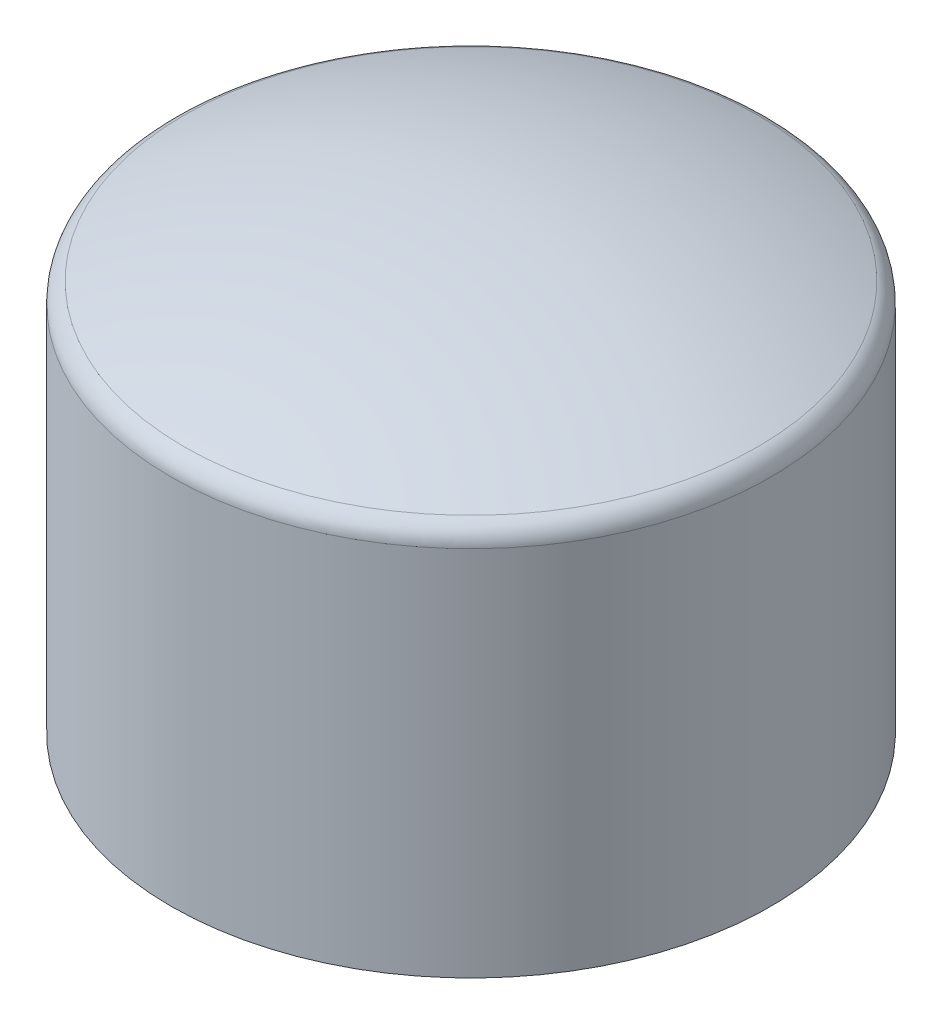
ISO-10303-21;
HEADER;
FILE_DESCRIPTION(('STEP AP214'),'2;1');
FILE_NAME('part.step','',(''),(''),'','','');
FILE_SCHEMA(('AUTOMOTIVE_DESIGN { 1 0 10303 214 1 1 1 1 }'));
ENDSEC;
DATA;
#1=APPLICATION_CONTEXT('core data for automotive mechanical design processes');
#2=APPLICATION_PROTOCOL_DEFINITION('international standard','automotive_design',2000,#1);
#3=PRODUCT_CONTEXT('',#1,'mechanical');
#4=PRODUCT('Part','Part','',(#3));
#5=PRODUCT_RELATED_PRODUCT_CATEGORY('part','',(#4));
#6=PRODUCT_DEFINITION_FORMATION('','',#4);
#7=PRODUCT_DEFINITION_CONTEXT('part definition',#1,'design');
#8=PRODUCT_DEFINITION('design','',#6,#7);
#9=PRODUCT_DEFINITION_SHAPE('','',#8);
#10=(LENGTH_UNIT() NAMED_UNIT(*) SI_UNIT(.MILLI.,.METRE.));
#11=(NAMED_UNIT(*) PLANE_ANGLE_UNIT() SI_UNIT($,.RADIAN.));
#12=(NAMED_UNIT(*) SI_UNIT($,.STERADIAN.) SOLID_ANGLE_UNIT());
#13=UNCERTAINTY_MEASURE_WITH_UNIT(LENGTH_MEASURE(1.E-05),#10,'distance_accuracy_value','');
#14=(GEOMETRIC_REPRESENTATION_CONTEXT(3) GLOBAL_UNCERTAINTY_ASSIGNED_CONTEXT((#13)) GLOBAL_UNIT_ASSIGNED_CONTEXT((#10,
#11,#12)) REPRESENTATION_CONTEXT('',''));
#15=CARTESIAN_POINT('',(0.,0.,0.));
#16=DIRECTION('',(0.,0.,1.));
#17=DIRECTION('',(1.,0.,0.));
#18=AXIS2_PLACEMENT_3D('',#15,#16,#17);
#19=CARTESIAN_POINT('',(0.,-6.58333333333332,0.));
#20=DIRECTION('',(0.,-1.,0.));
#21=DIRECTION('',(0.,0.,-1.));
#22=AXIS2_PLACEMENT_3D('',#19,#20,#21);
#23=SPHERICAL_SURFACE('',#22,17.0833333333333);
#24=CARTESIAN_POINT('',(0.,9.1330317350692,0.));
#25=DIRECTION('',(0.,-1.,0.));
#26=DIRECTION('',(0.,0.,-1.));
#27=AXIS2_PLACEMENT_3D('',#24,#25,#26);
#28=CIRCLE('',#27,6.69597989949749);
#29=CARTESIAN_POINT('',(0.,9.1330317350692,-6.69597989949749));
#30=VERTEX_POINT('',#29);
#31=EDGE_CURVE('E10',#30,#30,#28,.F.);
#32=ORIENTED_EDGE('',*,*,#31,.T.);
#33=EDGE_LOOP('',(#32));
#34=FACE_BOUND('',#33,.T.);
#35=ADVANCED_FACE('F32',(#34),#23,.T.);
#36=CARTESIAN_POINT('',(0.,0.,0.));
#37=DIRECTION('',(0.,-1.,0.));
#38=DIRECTION('',(0.,0.,-1.));
#39=AXIS2_PLACEMENT_3D('',#36,#37,#38);
#40=CYLINDRICAL_SURFACE('',#39,7.);
#41=CARTESIAN_POINT('',(0.,8.67304056233547,0.));
#42=DIRECTION('',(0.,-1.,0.));
#43=DIRECTION('',(0.,0.,-1.));
#44=AXIS2_PLACEMENT_3D('',#41,#42,#43);
#45=CIRCLE('',#44,7.);
#46=CARTESIAN_POINT('',(0.,8.67304056233547,-7.));
#47=VERTEX_POINT('',#46);
#48=EDGE_CURVE('E39',#47,#47,#45,.T.);
#49=ORIENTED_EDGE('',*,*,#48,.T.);
#50=EDGE_LOOP('',(#49));
#51=FACE_BOUND('',#50,.T.);
#52=CARTESIAN_POINT('',(0.,0.,0.));
#53=DIRECTION('',(0.,-1.,0.));
#54=DIRECTION('',(0.,0.,-1.));
#55=AXIS2_PLACEMENT_3D('',#52,#53,#54);
#56=CIRCLE('',#55,7.);
#57=CARTESIAN_POINT('',(0.,0.,-7.));
#58=VERTEX_POINT('',#57);
#59=EDGE_CURVE('E43',#58,#58,#56,.T.);
#60=ORIENTED_EDGE('',*,*,#59,.F.);
#61=EDGE_LOOP('',(#60));
#62=FACE_BOUND('',#61,.T.);
#63=ADVANCED_FACE('F52',(#51,#62),#40,.T.);
#64=CARTESIAN_POINT('',(0.,0.,0.));
#65=DIRECTION('',(0.,-1.,0.));
#66=DIRECTION('',(0.,0.,-1.));
#67=AXIS2_PLACEMENT_3D('',#64,#65,#66);
#68=PLANE('',#67);
#69=ORIENTED_EDGE('',*,*,#59,.T.);
#70=EDGE_LOOP('',(#69));
#71=FACE_BOUND('',#70,.T.);
#72=ADVANCED_FACE('F50',(#71),#68,.T.);
#73=CARTESIAN_POINT('',(0.,8.67304056233547,0.));
#74=DIRECTION('',(0.,-1.,0.));
#75=DIRECTION('',(0.,0.,-1.));
#76=AXIS2_PLACEMENT_3D('',#73,#74,#75);
#77=TOROIDAL_SURFACE('',#76,6.5,0.5);
#78=ORIENTED_EDGE('',*,*,#31,.F.);
#79=EDGE_LOOP('',(#78));
#80=FACE_BOUND('',#79,.T.);
#81=ORIENTED_EDGE('',*,*,#48,.F.);
#82=EDGE_LOOP('',(#81));
#83=FACE_BOUND('',#82,.T.);
#84=ADVANCED_FACE('F34',(#80,#83),#77,.T.);
#85=CLOSED_SHELL('',(#35,#63,#72,#84));
#86=MANIFOLD_SOLID_BREP('B2',#85);
#87=ADVANCED_BREP_SHAPE_REPRESENTATION('',(#18,#86),#14);
#88=SHAPE_DEFINITION_REPRESENTATION(#9,#87);
ENDSEC;
END-ISO-10303-21;
